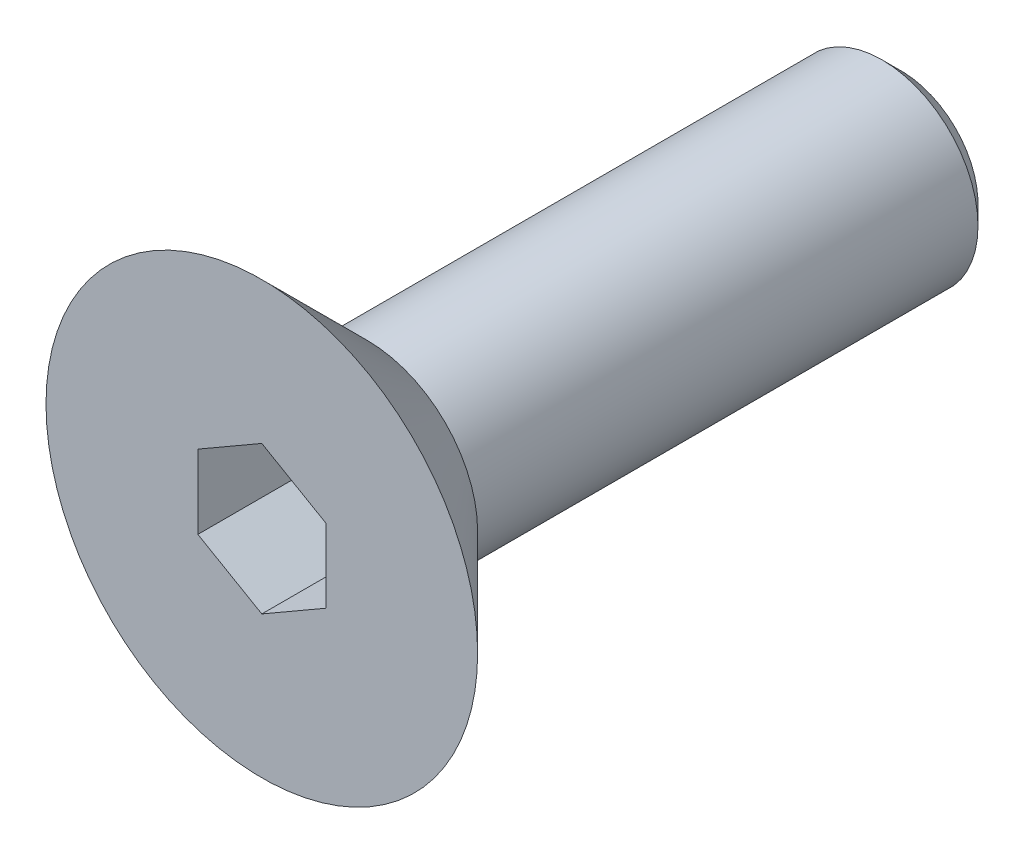
ISO-10303-21;
HEADER;
FILE_DESCRIPTION(('STEP AP214'),'2;1');
FILE_NAME('part.step','',(''),(''),'','','');
FILE_SCHEMA(('AUTOMOTIVE_DESIGN { 1 0 10303 214 1 1 1 1 }'));
ENDSEC;
DATA;
#1=APPLICATION_CONTEXT('core data for automotive mechanical design processes');
#2=APPLICATION_PROTOCOL_DEFINITION('international standard','automotive_design',2000,#1);
#3=PRODUCT_CONTEXT('',#1,'mechanical');
#4=PRODUCT('Part','Part','',(#3));
#5=PRODUCT_RELATED_PRODUCT_CATEGORY('part','',(#4));
#6=PRODUCT_DEFINITION_FORMATION('','',#4);
#7=PRODUCT_DEFINITION_CONTEXT('part definition',#1,'design');
#8=PRODUCT_DEFINITION('design','',#6,#7);
#9=PRODUCT_DEFINITION_SHAPE('','',#8);
#10=(LENGTH_UNIT() NAMED_UNIT(*) SI_UNIT(.MILLI.,.METRE.));
#11=(NAMED_UNIT(*) PLANE_ANGLE_UNIT() SI_UNIT($,.RADIAN.));
#12=(NAMED_UNIT(*) SI_UNIT($,.STERADIAN.) SOLID_ANGLE_UNIT());
#13=UNCERTAINTY_MEASURE_WITH_UNIT(LENGTH_MEASURE(1.E-05),#10,'distance_accuracy_value','');
#14=(GEOMETRIC_REPRESENTATION_CONTEXT(3) GLOBAL_UNCERTAINTY_ASSIGNED_CONTEXT((#13)) GLOBAL_UNIT_ASSIGNED_CONTEXT((#10,
#11,#12)) REPRESENTATION_CONTEXT('',''));
#15=CARTESIAN_POINT('',(0.,0.,0.));
#16=DIRECTION('',(0.,0.,1.));
#17=DIRECTION('',(1.,0.,0.));
#18=AXIS2_PLACEMENT_3D('',#15,#16,#17);
#19=CARTESIAN_POINT('',(0.,0.,0.));
#20=DIRECTION('',(0.,0.,1.));
#21=DIRECTION('',(1.,0.,0.));
#22=AXIS2_PLACEMENT_3D('',#19,#20,#21);
#23=PLANE('',#22);
#24=CARTESIAN_POINT('',(0.,0.,0.));
#25=DIRECTION('',(0.,0.,1.));
#26=DIRECTION('',(1.,0.,0.));
#27=AXIS2_PLACEMENT_3D('',#24,#25,#26);
#28=CIRCLE('',#27,1.725);
#29=CARTESIAN_POINT('',(1.725,0.,0.));
#30=VERTEX_POINT('',#29);
#31=EDGE_CURVE('E11',#30,#30,#28,.F.);
#32=ORIENTED_EDGE('',*,*,#31,.T.);
#33=EDGE_LOOP('',(#32));
#34=FACE_BOUND('',#33,.T.);
#35=CARTESIAN_POINT('',(0.,0.,0.));
#36=DIRECTION('',(0.,0.,1.));
#37=DIRECTION('',(1.,0.,0.));
#38=AXIS2_PLACEMENT_3D('',#35,#36,#37);
#39=CIRCLE('',#38,1.5);
#40=CARTESIAN_POINT('',(1.5,0.,0.));
#41=VERTEX_POINT('',#40);
#42=EDGE_CURVE('E144',#41,#41,#39,.F.);
#43=ORIENTED_EDGE('',*,*,#42,.F.);
#44=EDGE_LOOP('',(#43));
#45=FACE_BOUND('',#44,.T.);
#46=ADVANCED_FACE('F34',(#34,#45),#23,.F.);
#47=CARTESIAN_POINT('',(0.,0.,1.65));
#48=DIRECTION('',(0.,0.,1.));
#49=DIRECTION('',(1.,0.,0.));
#50=AXIS2_PLACEMENT_3D('',#47,#48,#49);
#51=PLANE('',#50);
#52=DIRECTION('',(-0.866025403784439,0.5,0.));
#53=VECTOR('',#52,1.);
#54=CARTESIAN_POINT('',(1.,0.577350269189626,1.65));
#55=LINE('',#54,#53);
#56=CARTESIAN_POINT('',(1.,0.577350269189626,1.65));
#57=VERTEX_POINT('',#56);
#58=CARTESIAN_POINT('',(0.,1.15470053837925,1.65));
#59=VERTEX_POINT('',#58);
#60=EDGE_CURVE('E49',#57,#59,#55,.T.);
#61=ORIENTED_EDGE('',*,*,#60,.F.);
#62=DIRECTION('',(0.,1.,0.));
#63=VECTOR('',#62,1.);
#64=CARTESIAN_POINT('',(1.,-0.577350269189626,1.65));
#65=LINE('',#64,#63);
#66=CARTESIAN_POINT('',(1.,-0.577350269189626,1.65));
#67=VERTEX_POINT('',#66);
#68=EDGE_CURVE('E132',#67,#57,#65,.T.);
#69=ORIENTED_EDGE('',*,*,#68,.F.);
#70=DIRECTION('',(0.866025403784439,0.5,0.));
#71=VECTOR('',#70,1.);
#72=CARTESIAN_POINT('',(0.,-1.15470053837925,1.65));
#73=LINE('',#72,#71);
#74=CARTESIAN_POINT('',(0.,-1.15470053837925,1.65));
#75=VERTEX_POINT('',#74);
#76=EDGE_CURVE('E130',#75,#67,#73,.T.);
#77=ORIENTED_EDGE('',*,*,#76,.F.);
#78=DIRECTION('',(0.866025403784439,-0.5,0.));
#79=VECTOR('',#78,1.);
#80=CARTESIAN_POINT('',(-1.,-0.577350269189626,1.65));
#81=LINE('',#80,#79);
#82=CARTESIAN_POINT('',(-1.,-0.577350269189626,1.65));
#83=VERTEX_POINT('',#82);
#84=EDGE_CURVE('E97',#83,#75,#81,.T.);
#85=ORIENTED_EDGE('',*,*,#84,.F.);
#86=DIRECTION('',(0.,-1.,0.));
#87=VECTOR('',#86,1.);
#88=CARTESIAN_POINT('',(-1.,0.577350269189626,1.65));
#89=LINE('',#88,#87);
#90=CARTESIAN_POINT('',(-1.,0.577350269189626,1.65));
#91=VERTEX_POINT('',#90);
#92=EDGE_CURVE('E126',#91,#83,#89,.T.);
#93=ORIENTED_EDGE('',*,*,#92,.F.);
#94=DIRECTION('',(-0.866025403784439,-0.5,0.));
#95=VECTOR('',#94,1.);
#96=CARTESIAN_POINT('',(0.,1.15470053837925,1.65));
#97=LINE('',#96,#95);
#98=EDGE_CURVE('E123',#59,#91,#97,.T.);
#99=ORIENTED_EDGE('',*,*,#98,.F.);
#100=EDGE_LOOP('',(#61,#69,#77,#85,#93,#99));
#101=FACE_BOUND('',#100,.T.);
#102=CARTESIAN_POINT('',(0.,0.,1.65));
#103=DIRECTION('',(0.,0.,1.));
#104=DIRECTION('',(1.,0.,0.));
#105=AXIS2_PLACEMENT_3D('',#102,#103,#104);
#106=CIRCLE('',#105,3.375);
#107=CARTESIAN_POINT('',(3.375,0.,1.65));
#108=VERTEX_POINT('',#107);
#109=EDGE_CURVE('E136',#108,#108,#106,.T.);
#110=ORIENTED_EDGE('',*,*,#109,.T.);
#111=EDGE_LOOP('',(#110));
#112=FACE_BOUND('',#111,.T.);
#113=ADVANCED_FACE('F167',(#101,#112),#51,.T.);
#114=CARTESIAN_POINT('',(0.,0.,-8.35));
#115=DIRECTION('',(0.,0.,1.));
#116=DIRECTION('',(1.,0.,0.));
#117=AXIS2_PLACEMENT_3D('',#114,#115,#116);
#118=CYLINDRICAL_SURFACE('',#117,1.5);
#119=CARTESIAN_POINT('',(0.,0.,-8.05));
#120=DIRECTION('',(0.,0.,-1.));
#121=DIRECTION('',(-1.,0.,0.));
#122=AXIS2_PLACEMENT_3D('',#119,#120,#121);
#123=CIRCLE('',#122,1.5);
#124=CARTESIAN_POINT('',(-1.5,0.,-8.05));
#125=VERTEX_POINT('',#124);
#126=EDGE_CURVE('E42',#125,#125,#123,.F.);
#127=ORIENTED_EDGE('',*,*,#126,.T.);
#128=EDGE_LOOP('',(#127));
#129=FACE_BOUND('',#128,.T.);
#130=ORIENTED_EDGE('',*,*,#42,.T.);
#131=EDGE_LOOP('',(#130));
#132=FACE_BOUND('',#131,.T.);
#133=ADVANCED_FACE('F152',(#129,#132),#118,.T.);
#134=CARTESIAN_POINT('',(0.,0.,-8.35));
#135=DIRECTION('',(0.,0.,-1.));
#136=DIRECTION('',(-1.,0.,0.));
#137=AXIS2_PLACEMENT_3D('',#134,#135,#136);
#138=PLANE('',#137);
#139=CARTESIAN_POINT('',(0.,0.,-8.35));
#140=DIRECTION('',(0.,0.,-1.));
#141=DIRECTION('',(-1.,0.,0.));
#142=AXIS2_PLACEMENT_3D('',#139,#140,#141);
#143=CIRCLE('',#142,1.2);
#144=CARTESIAN_POINT('',(-1.2,0.,-8.35));
#145=VERTEX_POINT('',#144);
#146=EDGE_CURVE('E147',#145,#145,#143,.T.);
#147=ORIENTED_EDGE('',*,*,#146,.T.);
#148=EDGE_LOOP('',(#147));
#149=FACE_BOUND('',#148,.T.);
#150=ADVANCED_FACE('F159',(#149),#138,.T.);
#151=CARTESIAN_POINT('',(0.,0.,-8.35));
#152=DIRECTION('',(0.,0.,1.));
#153=DIRECTION('',(1.,0.,0.));
#154=AXIS2_PLACEMENT_3D('',#151,#152,#153);
#155=CONICAL_SURFACE('',#154,1.2,0.785398163397447);
#156=ORIENTED_EDGE('',*,*,#126,.F.);
#157=EDGE_LOOP('',(#156));
#158=FACE_BOUND('',#157,.T.);
#159=ORIENTED_EDGE('',*,*,#146,.F.);
#160=EDGE_LOOP('',(#159));
#161=FACE_BOUND('',#160,.T.);
#162=ADVANCED_FACE('F155',(#158,#161),#155,.T.);
#163=CARTESIAN_POINT('',(1.,0.577350269189626,-0.35));
#164=DIRECTION('',(0.5,0.866025403784439,0.));
#165=DIRECTION('',(-0.866025403784439,0.5,0.));
#166=AXIS2_PLACEMENT_3D('',#163,#164,#165);
#167=PLANE('',#166);
#168=ORIENTED_EDGE('',*,*,#60,.T.);
#169=DIRECTION('',(0.,0.,1.));
#170=VECTOR('',#169,1.);
#171=CARTESIAN_POINT('',(0.,1.15470053837925,-0.35));
#172=LINE('',#171,#170);
#173=CARTESIAN_POINT('',(0.,1.15470053837925,-0.35));
#174=VERTEX_POINT('',#173);
#175=EDGE_CURVE('E79',#174,#59,#172,.T.);
#176=ORIENTED_EDGE('',*,*,#175,.F.);
#177=DIRECTION('',(-0.866025403784439,0.5,0.));
#178=VECTOR('',#177,1.);
#179=CARTESIAN_POINT('',(1.,0.577350269189626,-0.35));
#180=LINE('',#179,#178);
#181=CARTESIAN_POINT('',(1.,0.577350269189626,-0.35));
#182=VERTEX_POINT('',#181);
#183=EDGE_CURVE('E134',#182,#174,#180,.T.);
#184=ORIENTED_EDGE('',*,*,#183,.F.);
#185=DIRECTION('',(0.,0.,1.));
#186=VECTOR('',#185,1.);
#187=CARTESIAN_POINT('',(1.,0.577350269189626,-0.35));
#188=LINE('',#187,#186);
#189=EDGE_CURVE('E57',#182,#57,#188,.T.);
#190=ORIENTED_EDGE('',*,*,#189,.T.);
#191=EDGE_LOOP('',(#168,#176,#184,#190));
#192=FACE_BOUND('',#191,.T.);
#193=ADVANCED_FACE('F158',(#192),#167,.F.);
#194=CARTESIAN_POINT('',(1.,-0.577350269189626,-0.35));
#195=DIRECTION('',(1.,0.,0.));
#196=DIRECTION('',(0.,1.,0.));
#197=AXIS2_PLACEMENT_3D('',#194,#195,#196);
#198=PLANE('',#197);
#199=ORIENTED_EDGE('',*,*,#68,.T.);
#200=ORIENTED_EDGE('',*,*,#189,.F.);
#201=DIRECTION('',(0.,1.,0.));
#202=VECTOR('',#201,1.);
#203=CARTESIAN_POINT('',(1.,-0.577350269189626,-0.35));
#204=LINE('',#203,#202);
#205=CARTESIAN_POINT('',(1.,-0.577350269189626,-0.35));
#206=VERTEX_POINT('',#205);
#207=EDGE_CURVE('E109',#206,#182,#204,.T.);
#208=ORIENTED_EDGE('',*,*,#207,.F.);
#209=DIRECTION('',(0.,0.,1.));
#210=VECTOR('',#209,1.);
#211=CARTESIAN_POINT('',(1.,-0.577350269189626,-0.35));
#212=LINE('',#211,#210);
#213=EDGE_CURVE('E101',#206,#67,#212,.T.);
#214=ORIENTED_EDGE('',*,*,#213,.T.);
#215=EDGE_LOOP('',(#199,#200,#208,#214));
#216=FACE_BOUND('',#215,.T.);
#217=ADVANCED_FACE('F198',(#216),#198,.F.);
#218=CARTESIAN_POINT('',(0.,-1.15470053837925,-0.35));
#219=DIRECTION('',(0.5,-0.866025403784439,0.));
#220=DIRECTION('',(0.866025403784439,0.5,0.));
#221=AXIS2_PLACEMENT_3D('',#218,#219,#220);
#222=PLANE('',#221);
#223=ORIENTED_EDGE('',*,*,#76,.T.);
#224=ORIENTED_EDGE('',*,*,#213,.F.);
#225=DIRECTION('',(0.866025403784439,0.5,0.));
#226=VECTOR('',#225,1.);
#227=CARTESIAN_POINT('',(0.,-1.15470053837925,-0.35));
#228=LINE('',#227,#226);
#229=CARTESIAN_POINT('',(0.,-1.15470053837925,-0.35));
#230=VERTEX_POINT('',#229);
#231=EDGE_CURVE('E105',#230,#206,#228,.T.);
#232=ORIENTED_EDGE('',*,*,#231,.F.);
#233=DIRECTION('',(0.,0.,1.));
#234=VECTOR('',#233,1.);
#235=CARTESIAN_POINT('',(0.,-1.15470053837925,-0.35));
#236=LINE('',#235,#234);
#237=EDGE_CURVE('E90',#230,#75,#236,.T.);
#238=ORIENTED_EDGE('',*,*,#237,.T.);
#239=EDGE_LOOP('',(#223,#224,#232,#238));
#240=FACE_BOUND('',#239,.T.);
#241=ADVANCED_FACE('F106',(#240),#222,.F.);
#242=CARTESIAN_POINT('',(-1.,-0.577350269189626,-0.35));
#243=DIRECTION('',(-0.5,-0.866025403784439,0.));
#244=DIRECTION('',(0.866025403784439,-0.5,0.));
#245=AXIS2_PLACEMENT_3D('',#242,#243,#244);
#246=PLANE('',#245);
#247=ORIENTED_EDGE('',*,*,#84,.T.);
#248=ORIENTED_EDGE('',*,*,#237,.F.);
#249=DIRECTION('',(0.866025403784439,-0.5,0.));
#250=VECTOR('',#249,1.);
#251=CARTESIAN_POINT('',(-1.,-0.577350269189626,-0.35));
#252=LINE('',#251,#250);
#253=CARTESIAN_POINT('',(-1.,-0.577350269189626,-0.35));
#254=VERTEX_POINT('',#253);
#255=EDGE_CURVE('E94',#254,#230,#252,.T.);
#256=ORIENTED_EDGE('',*,*,#255,.F.);
#257=DIRECTION('',(0.,0.,1.));
#258=VECTOR('',#257,1.);
#259=CARTESIAN_POINT('',(-1.,-0.577350269189626,-0.35));
#260=LINE('',#259,#258);
#261=EDGE_CURVE('E102',#254,#83,#260,.T.);
#262=ORIENTED_EDGE('',*,*,#261,.T.);
#263=EDGE_LOOP('',(#247,#248,#256,#262));
#264=FACE_BOUND('',#263,.T.);
#265=ADVANCED_FACE('F92',(#264),#246,.F.);
#266=CARTESIAN_POINT('',(-1.,0.577350269189626,-0.35));
#267=DIRECTION('',(-1.,0.,0.));
#268=DIRECTION('',(0.,-1.,0.));
#269=AXIS2_PLACEMENT_3D('',#266,#267,#268);
#270=PLANE('',#269);
#271=ORIENTED_EDGE('',*,*,#92,.T.);
#272=ORIENTED_EDGE('',*,*,#261,.F.);
#273=DIRECTION('',(0.,-1.,0.));
#274=VECTOR('',#273,1.);
#275=CARTESIAN_POINT('',(-1.,0.577350269189626,-0.35));
#276=LINE('',#275,#274);
#277=CARTESIAN_POINT('',(-1.,0.577350269189626,-0.35));
#278=VERTEX_POINT('',#277);
#279=EDGE_CURVE('E115',#278,#254,#276,.T.);
#280=ORIENTED_EDGE('',*,*,#279,.F.);
#281=DIRECTION('',(0.,0.,1.));
#282=VECTOR('',#281,1.);
#283=CARTESIAN_POINT('',(-1.,0.577350269189626,-0.35));
#284=LINE('',#283,#282);
#285=EDGE_CURVE('E139',#278,#91,#284,.T.);
#286=ORIENTED_EDGE('',*,*,#285,.T.);
#287=EDGE_LOOP('',(#271,#272,#280,#286));
#288=FACE_BOUND('',#287,.T.);
#289=ADVANCED_FACE('F194',(#288),#270,.F.);
#290=CARTESIAN_POINT('',(0.,1.15470053837925,-0.35));
#291=DIRECTION('',(-0.5,0.866025403784439,0.));
#292=DIRECTION('',(-0.866025403784439,-0.5,0.));
#293=AXIS2_PLACEMENT_3D('',#290,#291,#292);
#294=PLANE('',#293);
#295=ORIENTED_EDGE('',*,*,#98,.T.);
#296=ORIENTED_EDGE('',*,*,#285,.F.);
#297=DIRECTION('',(-0.866025403784439,-0.5,0.));
#298=VECTOR('',#297,1.);
#299=CARTESIAN_POINT('',(0.,1.15470053837925,-0.35));
#300=LINE('',#299,#298);
#301=EDGE_CURVE('E117',#174,#278,#300,.T.);
#302=ORIENTED_EDGE('',*,*,#301,.F.);
#303=ORIENTED_EDGE('',*,*,#175,.T.);
#304=EDGE_LOOP('',(#295,#296,#302,#303));
#305=FACE_BOUND('',#304,.T.);
#306=ADVANCED_FACE('F189',(#305),#294,.F.);
#307=CARTESIAN_POINT('',(0.,0.,-0.35));
#308=DIRECTION('',(0.,0.,1.));
#309=DIRECTION('',(1.,0.,0.));
#310=AXIS2_PLACEMENT_3D('',#307,#308,#309);
#311=PLANE('',#310);
#312=ORIENTED_EDGE('',*,*,#183,.T.);
#313=ORIENTED_EDGE('',*,*,#301,.T.);
#314=ORIENTED_EDGE('',*,*,#279,.T.);
#315=ORIENTED_EDGE('',*,*,#255,.T.);
#316=ORIENTED_EDGE('',*,*,#231,.T.);
#317=ORIENTED_EDGE('',*,*,#207,.T.);
#318=EDGE_LOOP('',(#312,#313,#314,#315,#316,#317));
#319=FACE_BOUND('',#318,.T.);
#320=ADVANCED_FACE('F112',(#319),#311,.T.);
#321=CARTESIAN_POINT('',(0.,0.,1.65));
#322=DIRECTION('',(0.,0.,1.));
#323=DIRECTION('',(1.,0.,0.));
#324=AXIS2_PLACEMENT_3D('',#321,#322,#323);
#325=CONICAL_SURFACE('',#324,3.375,0.78539816339745);
#326=ORIENTED_EDGE('',*,*,#31,.F.);
#327=EDGE_LOOP('',(#326));
#328=FACE_BOUND('',#327,.T.);
#329=ORIENTED_EDGE('',*,*,#109,.F.);
#330=EDGE_LOOP('',(#329));
#331=FACE_BOUND('',#330,.T.);
#332=ADVANCED_FACE('F36',(#328,#331),#325,.T.);
#333=CLOSED_SHELL('',(#46,#113,#133,#150,#162,#193,#217,#241,#265,#289,#306,#320,#332));
#334=MANIFOLD_SOLID_BREP('B2',#333);
#335=ADVANCED_BREP_SHAPE_REPRESENTATION('',(#18,#334),#14);
#336=SHAPE_DEFINITION_REPRESENTATION(#9,#335);
ENDSEC;
END-ISO-10303-21;
